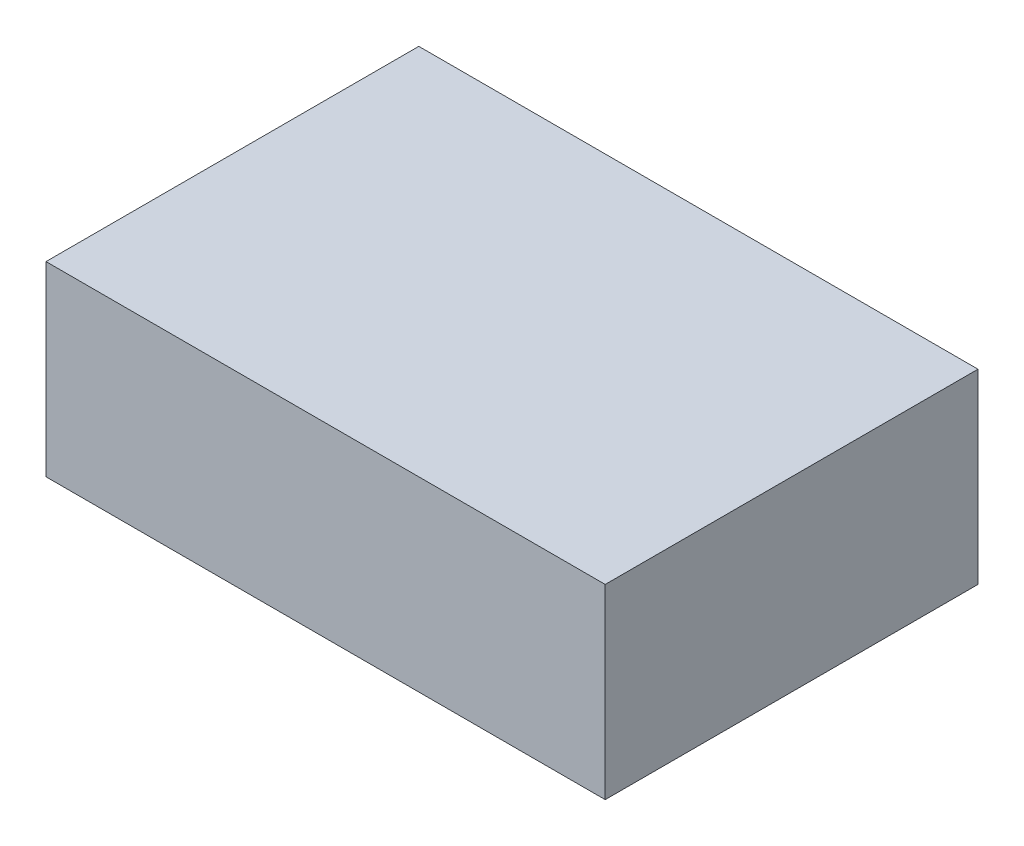
ISO-10303-21;
HEADER;
FILE_DESCRIPTION(('STEP AP214'),'2;1');
FILE_NAME('part.step','',(''),(''),'','','');
FILE_SCHEMA(('AUTOMOTIVE_DESIGN { 1 0 10303 214 1 1 1 1 }'));
ENDSEC;
DATA;
#1=APPLICATION_CONTEXT('core data for automotive mechanical design processes');
#2=APPLICATION_PROTOCOL_DEFINITION('international standard','automotive_design',2000,#1);
#3=PRODUCT_CONTEXT('',#1,'mechanical');
#4=PRODUCT('Part','Part','',(#3));
#5=PRODUCT_RELATED_PRODUCT_CATEGORY('part','',(#4));
#6=PRODUCT_DEFINITION_FORMATION('','',#4);
#7=PRODUCT_DEFINITION_CONTEXT('part definition',#1,'design');
#8=PRODUCT_DEFINITION('design','',#6,#7);
#9=PRODUCT_DEFINITION_SHAPE('','',#8);
#10=(LENGTH_UNIT() NAMED_UNIT(*) SI_UNIT(.MILLI.,.METRE.));
#11=(NAMED_UNIT(*) PLANE_ANGLE_UNIT() SI_UNIT($,.RADIAN.));
#12=(NAMED_UNIT(*) SI_UNIT($,.STERADIAN.) SOLID_ANGLE_UNIT());
#13=UNCERTAINTY_MEASURE_WITH_UNIT(LENGTH_MEASURE(1.E-05),#10,'distance_accuracy_value','');
#14=(GEOMETRIC_REPRESENTATION_CONTEXT(3) GLOBAL_UNCERTAINTY_ASSIGNED_CONTEXT((#13)) GLOBAL_UNIT_ASSIGNED_CONTEXT((#10,
#11,#12)) REPRESENTATION_CONTEXT('',''));
#15=CARTESIAN_POINT('',(0.,0.,0.));
#16=DIRECTION('',(0.,0.,1.));
#17=DIRECTION('',(1.,0.,0.));
#18=AXIS2_PLACEMENT_3D('',#15,#16,#17);
#19=CARTESIAN_POINT('',(0.,0.,0.));
#20=DIRECTION('',(0.,1.,0.));
#21=DIRECTION('',(0.,0.,1.));
#22=AXIS2_PLACEMENT_3D('',#19,#20,#21);
#23=PLANE('',#22);
#24=DIRECTION('',(-1.,0.,0.));
#25=VECTOR('',#24,1.);
#26=CARTESIAN_POINT('',(-0.6,0.,0.4));
#27=LINE('',#26,#25);
#28=CARTESIAN_POINT('',(0.6,0.,0.4));
#29=VERTEX_POINT('',#28);
#30=CARTESIAN_POINT('',(-0.6,0.,0.4));
#31=VERTEX_POINT('',#30);
#32=EDGE_CURVE('E81',#29,#31,#27,.T.);
#33=ORIENTED_EDGE('',*,*,#32,.T.);
#34=DIRECTION('',(0.,0.,-1.));
#35=VECTOR('',#34,1.);
#36=CARTESIAN_POINT('',(-0.6,0.,-0.4));
#37=LINE('',#36,#35);
#38=CARTESIAN_POINT('',(-0.6,0.,-0.4));
#39=VERTEX_POINT('',#38);
#40=EDGE_CURVE('E68',#31,#39,#37,.T.);
#41=ORIENTED_EDGE('',*,*,#40,.T.);
#42=DIRECTION('',(1.,0.,0.));
#43=VECTOR('',#42,1.);
#44=CARTESIAN_POINT('',(-0.6,0.,-0.4));
#45=LINE('',#44,#43);
#46=CARTESIAN_POINT('',(0.6,0.,-0.4));
#47=VERTEX_POINT('',#46);
#48=EDGE_CURVE('E55',#39,#47,#45,.T.);
#49=ORIENTED_EDGE('',*,*,#48,.T.);
#50=DIRECTION('',(0.,0.,1.));
#51=VECTOR('',#50,1.);
#52=CARTESIAN_POINT('',(0.6,0.,-0.4));
#53=LINE('',#52,#51);
#54=EDGE_CURVE('E20',#47,#29,#53,.T.);
#55=ORIENTED_EDGE('',*,*,#54,.T.);
#56=EDGE_LOOP('',(#33,#41,#49,#55));
#57=FACE_BOUND('',#56,.T.);
#58=ADVANCED_FACE('F17',(#57),#23,.F.);
#59=CARTESIAN_POINT('',(0.6,0.4,-0.4));
#60=DIRECTION('',(-1.,0.,0.));
#61=DIRECTION('',(0.,0.,1.));
#62=AXIS2_PLACEMENT_3D('',#59,#60,#61);
#63=PLANE('',#62);
#64=DIRECTION('',(0.,1.,0.));
#65=VECTOR('',#64,1.);
#66=CARTESIAN_POINT('',(0.6,0.4,-0.4));
#67=LINE('',#66,#65);
#68=CARTESIAN_POINT('',(0.6,0.4,-0.4));
#69=VERTEX_POINT('',#68);
#70=EDGE_CURVE('E61',#47,#69,#67,.T.);
#71=ORIENTED_EDGE('',*,*,#70,.T.);
#72=DIRECTION('',(0.,0.,1.));
#73=VECTOR('',#72,1.);
#74=CARTESIAN_POINT('',(0.6,0.4,0.));
#75=LINE('',#74,#73);
#76=CARTESIAN_POINT('',(0.6,0.4,0.4));
#77=VERTEX_POINT('',#76);
#78=EDGE_CURVE('E83',#77,#69,#75,.F.);
#79=ORIENTED_EDGE('',*,*,#78,.F.);
#80=DIRECTION('',(0.,1.,0.));
#81=VECTOR('',#80,1.);
#82=CARTESIAN_POINT('',(0.6,0.4,0.4));
#83=LINE('',#82,#81);
#84=EDGE_CURVE('E64',#77,#29,#83,.F.);
#85=ORIENTED_EDGE('',*,*,#84,.T.);
#86=ORIENTED_EDGE('',*,*,#54,.F.);
#87=EDGE_LOOP('',(#71,#79,#85,#86));
#88=FACE_BOUND('',#87,.T.);
#89=ADVANCED_FACE('F60',(#88),#63,.F.);
#90=CARTESIAN_POINT('',(-0.6,0.4,-0.4));
#91=DIRECTION('',(0.,0.,1.));
#92=DIRECTION('',(1.,0.,0.));
#93=AXIS2_PLACEMENT_3D('',#90,#91,#92);
#94=PLANE('',#93);
#95=DIRECTION('',(0.,1.,0.));
#96=VECTOR('',#95,1.);
#97=CARTESIAN_POINT('',(-0.6,0.4,-0.4));
#98=LINE('',#97,#96);
#99=CARTESIAN_POINT('',(-0.6,0.4,-0.4));
#100=VERTEX_POINT('',#99);
#101=EDGE_CURVE('E70',#39,#100,#98,.T.);
#102=ORIENTED_EDGE('',*,*,#101,.T.);
#103=DIRECTION('',(1.,0.,0.));
#104=VECTOR('',#103,1.);
#105=CARTESIAN_POINT('',(0.,0.4,-0.4));
#106=LINE('',#105,#104);
#107=EDGE_CURVE('E74',#69,#100,#106,.F.);
#108=ORIENTED_EDGE('',*,*,#107,.F.);
#109=ORIENTED_EDGE('',*,*,#70,.F.);
#110=ORIENTED_EDGE('',*,*,#48,.F.);
#111=EDGE_LOOP('',(#102,#108,#109,#110));
#112=FACE_BOUND('',#111,.T.);
#113=ADVANCED_FACE('F72',(#112),#94,.F.);
#114=CARTESIAN_POINT('',(-0.6,0.4,-0.4));
#115=DIRECTION('',(1.,0.,0.));
#116=DIRECTION('',(0.,0.,-1.));
#117=AXIS2_PLACEMENT_3D('',#114,#115,#116);
#118=PLANE('',#117);
#119=DIRECTION('',(0.,1.,0.));
#120=VECTOR('',#119,1.);
#121=CARTESIAN_POINT('',(-0.6,0.4,0.4));
#122=LINE('',#121,#120);
#123=CARTESIAN_POINT('',(-0.6,0.4,0.4));
#124=VERTEX_POINT('',#123);
#125=EDGE_CURVE('E35',#31,#124,#122,.T.);
#126=ORIENTED_EDGE('',*,*,#125,.T.);
#127=DIRECTION('',(0.,0.,1.));
#128=VECTOR('',#127,1.);
#129=CARTESIAN_POINT('',(-0.6,0.4,0.));
#130=LINE('',#129,#128);
#131=EDGE_CURVE('E26',#100,#124,#130,.T.);
#132=ORIENTED_EDGE('',*,*,#131,.F.);
#133=ORIENTED_EDGE('',*,*,#101,.F.);
#134=ORIENTED_EDGE('',*,*,#40,.F.);
#135=EDGE_LOOP('',(#126,#132,#133,#134));
#136=FACE_BOUND('',#135,.T.);
#137=ADVANCED_FACE('F89',(#136),#118,.F.);
#138=CARTESIAN_POINT('',(-0.6,0.4,0.4));
#139=DIRECTION('',(0.,0.,-1.));
#140=DIRECTION('',(-1.,0.,0.));
#141=AXIS2_PLACEMENT_3D('',#138,#139,#140);
#142=PLANE('',#141);
#143=ORIENTED_EDGE('',*,*,#84,.F.);
#144=DIRECTION('',(1.,0.,0.));
#145=VECTOR('',#144,1.);
#146=CARTESIAN_POINT('',(0.,0.4,0.4));
#147=LINE('',#146,#145);
#148=EDGE_CURVE('E11',#124,#77,#147,.T.);
#149=ORIENTED_EDGE('',*,*,#148,.F.);
#150=ORIENTED_EDGE('',*,*,#125,.F.);
#151=ORIENTED_EDGE('',*,*,#32,.F.);
#152=EDGE_LOOP('',(#143,#149,#150,#151));
#153=FACE_BOUND('',#152,.T.);
#154=ADVANCED_FACE('F91',(#153),#142,.F.);
#155=CARTESIAN_POINT('',(0.,0.4,0.));
#156=DIRECTION('',(0.,1.,0.));
#157=DIRECTION('',(0.,0.,1.));
#158=AXIS2_PLACEMENT_3D('',#155,#156,#157);
#159=PLANE('',#158);
#160=ORIENTED_EDGE('',*,*,#131,.T.);
#161=ORIENTED_EDGE('',*,*,#148,.T.);
#162=ORIENTED_EDGE('',*,*,#78,.T.);
#163=ORIENTED_EDGE('',*,*,#107,.T.);
#164=EDGE_LOOP('',(#160,#161,#162,#163));
#165=FACE_BOUND('',#164,.T.);
#166=ADVANCED_FACE('F88',(#165),#159,.T.);
#167=CLOSED_SHELL('',(#58,#89,#113,#137,#154,#166));
#168=MANIFOLD_SOLID_BREP('B1',#167);
#169=ADVANCED_BREP_SHAPE_REPRESENTATION('',(#18,#168),#14);
#170=SHAPE_DEFINITION_REPRESENTATION(#9,#169);
ENDSEC;
END-ISO-10303-21;
